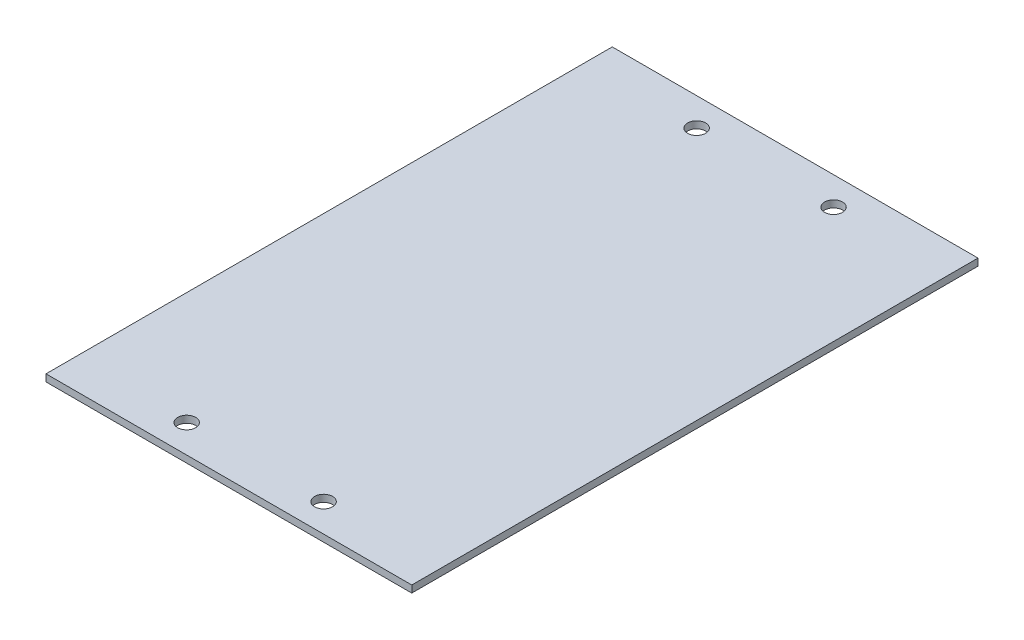
ISO-10303-21;
HEADER;
FILE_DESCRIPTION(('STEP AP214'),'2;1');
FILE_NAME('part.step','',(''),(''),'','','');
FILE_SCHEMA(('AUTOMOTIVE_DESIGN { 1 0 10303 214 1 1 1 1 }'));
ENDSEC;
DATA;
#1=APPLICATION_CONTEXT('core data for automotive mechanical design processes');
#2=APPLICATION_PROTOCOL_DEFINITION('international standard','automotive_design',2000,#1);
#3=PRODUCT_CONTEXT('',#1,'mechanical');
#4=PRODUCT('Part','Part','',(#3));
#5=PRODUCT_RELATED_PRODUCT_CATEGORY('part','',(#4));
#6=PRODUCT_DEFINITION_FORMATION('','',#4);
#7=PRODUCT_DEFINITION_CONTEXT('part definition',#1,'design');
#8=PRODUCT_DEFINITION('design','',#6,#7);
#9=PRODUCT_DEFINITION_SHAPE('','',#8);
#10=(LENGTH_UNIT() NAMED_UNIT(*) SI_UNIT(.MILLI.,.METRE.));
#11=(NAMED_UNIT(*) PLANE_ANGLE_UNIT() SI_UNIT($,.RADIAN.));
#12=(NAMED_UNIT(*) SI_UNIT($,.STERADIAN.) SOLID_ANGLE_UNIT());
#13=UNCERTAINTY_MEASURE_WITH_UNIT(LENGTH_MEASURE(1.E-05),#10,'distance_accuracy_value','');
#14=(GEOMETRIC_REPRESENTATION_CONTEXT(3) GLOBAL_UNCERTAINTY_ASSIGNED_CONTEXT((#13)) GLOBAL_UNIT_ASSIGNED_CONTEXT((#10,
#11,#12)) REPRESENTATION_CONTEXT('',''));
#15=CARTESIAN_POINT('',(0.,0.,0.));
#16=DIRECTION('',(0.,0.,1.));
#17=DIRECTION('',(1.,0.,0.));
#18=AXIS2_PLACEMENT_3D('',#15,#16,#17);
#19=CARTESIAN_POINT('',(0.,0.,-511.175));
#20=DIRECTION('',(-1.,0.,0.));
#21=DIRECTION('',(0.,0.,1.));
#22=AXIS2_PLACEMENT_3D('',#19,#20,#21);
#23=PLANE('',#22);
#24=DIRECTION('',(0.,-1.,0.));
#25=VECTOR('',#24,1.);
#26=CARTESIAN_POINT('',(0.,0.,0.));
#27=LINE('',#26,#25);
#28=CARTESIAN_POINT('',(0.,6.35,0.));
#29=VERTEX_POINT('',#28);
#30=CARTESIAN_POINT('',(0.,0.,0.));
#31=VERTEX_POINT('',#30);
#32=EDGE_CURVE('E104',#29,#31,#27,.T.);
#33=ORIENTED_EDGE('',*,*,#32,.F.);
#34=DIRECTION('',(0.,0.,1.));
#35=VECTOR('',#34,1.);
#36=CARTESIAN_POINT('',(0.,6.35,-511.175));
#37=LINE('',#36,#35);
#38=CARTESIAN_POINT('',(0.,6.35,-511.175));
#39=VERTEX_POINT('',#38);
#40=EDGE_CURVE('E11',#39,#29,#37,.T.);
#41=ORIENTED_EDGE('',*,*,#40,.F.);
#42=DIRECTION('',(0.,-1.,0.));
#43=VECTOR('',#42,1.);
#44=CARTESIAN_POINT('',(0.,0.,-511.175));
#45=LINE('',#44,#43);
#46=CARTESIAN_POINT('',(0.,0.,-511.175));
#47=VERTEX_POINT('',#46);
#48=EDGE_CURVE('E97',#39,#47,#45,.T.);
#49=ORIENTED_EDGE('',*,*,#48,.T.);
#50=DIRECTION('',(0.,0.,1.));
#51=VECTOR('',#50,1.);
#52=CARTESIAN_POINT('',(0.,0.,-511.175));
#53=LINE('',#52,#51);
#54=EDGE_CURVE('E42',#47,#31,#53,.T.);
#55=ORIENTED_EDGE('',*,*,#54,.T.);
#56=EDGE_LOOP('',(#33,#41,#49,#55));
#57=FACE_BOUND('',#56,.T.);
#58=ADVANCED_FACE('F39',(#57),#23,.T.);
#59=CARTESIAN_POINT('',(0.,6.35,-511.175));
#60=DIRECTION('',(0.,1.,0.));
#61=DIRECTION('',(0.,0.,1.));
#62=AXIS2_PLACEMENT_3D('',#59,#60,#61);
#63=PLANE('',#62);
#64=CARTESIAN_POINT('',(101.6,6.35,-485.775));
#65=DIRECTION('',(0.,1.,0.));
#66=DIRECTION('',(0.,0.,-1.));
#67=AXIS2_PLACEMENT_3D('',#64,#65,#66);
#68=CIRCLE('',#67,8.12800000000003);
#69=CARTESIAN_POINT('',(101.6,6.35,-493.903));
#70=VERTEX_POINT('',#69);
#71=EDGE_CURVE('E156',#70,#70,#68,.T.);
#72=ORIENTED_EDGE('',*,*,#71,.F.);
#73=EDGE_LOOP('',(#72));
#74=FACE_BOUND('',#73,.T.);
#75=CARTESIAN_POINT('',(225.199138423379,6.35,-485.775));
#76=DIRECTION('',(0.,1.,0.));
#77=DIRECTION('',(0.,0.,1.));
#78=AXIS2_PLACEMENT_3D('',#75,#76,#77);
#79=CIRCLE('',#78,8.12800000000003);
#80=CARTESIAN_POINT('',(225.199138423379,6.35,-477.647));
#81=VERTEX_POINT('',#80);
#82=EDGE_CURVE('E160',#81,#81,#79,.T.);
#83=ORIENTED_EDGE('',*,*,#82,.F.);
#84=EDGE_LOOP('',(#83));
#85=FACE_BOUND('',#84,.T.);
#86=CARTESIAN_POINT('',(225.199138423379,6.35,-25.4));
#87=DIRECTION('',(0.,1.,0.));
#88=DIRECTION('',(0.,0.,-1.));
#89=AXIS2_PLACEMENT_3D('',#86,#87,#88);
#90=CIRCLE('',#89,8.12800000000003);
#91=CARTESIAN_POINT('',(225.199138423379,6.35,-33.528));
#92=VERTEX_POINT('',#91);
#93=EDGE_CURVE('E153',#92,#92,#90,.T.);
#94=ORIENTED_EDGE('',*,*,#93,.F.);
#95=EDGE_LOOP('',(#94));
#96=FACE_BOUND('',#95,.T.);
#97=CARTESIAN_POINT('',(101.6,6.35,-25.4));
#98=DIRECTION('',(0.,1.,0.));
#99=DIRECTION('',(0.,0.,1.));
#100=AXIS2_PLACEMENT_3D('',#97,#98,#99);
#101=CIRCLE('',#100,8.128);
#102=CARTESIAN_POINT('',(101.6,6.35,-17.272));
#103=VERTEX_POINT('',#102);
#104=EDGE_CURVE('E108',#103,#103,#101,.T.);
#105=ORIENTED_EDGE('',*,*,#104,.F.);
#106=EDGE_LOOP('',(#105));
#107=FACE_BOUND('',#106,.T.);
#108=DIRECTION('',(-1.,0.,0.));
#109=VECTOR('',#108,1.);
#110=CARTESIAN_POINT('',(0.,6.35,0.));
#111=LINE('',#110,#109);
#112=CARTESIAN_POINT('',(330.2,6.35,0.));
#113=VERTEX_POINT('',#112);
#114=EDGE_CURVE('E99',#113,#29,#111,.T.);
#115=ORIENTED_EDGE('',*,*,#114,.F.);
#116=DIRECTION('',(0.,0.,1.));
#117=VECTOR('',#116,1.);
#118=CARTESIAN_POINT('',(330.2,6.35,-511.175));
#119=LINE('',#118,#117);
#120=CARTESIAN_POINT('',(330.2,6.35,-511.175));
#121=VERTEX_POINT('',#120);
#122=EDGE_CURVE('E48',#121,#113,#119,.T.);
#123=ORIENTED_EDGE('',*,*,#122,.F.);
#124=DIRECTION('',(-1.,0.,0.));
#125=VECTOR('',#124,1.);
#126=CARTESIAN_POINT('',(0.,6.35,-511.175));
#127=LINE('',#126,#125);
#128=EDGE_CURVE('E94',#121,#39,#127,.T.);
#129=ORIENTED_EDGE('',*,*,#128,.T.);
#130=ORIENTED_EDGE('',*,*,#40,.T.);
#131=EDGE_LOOP('',(#115,#123,#129,#130));
#132=FACE_BOUND('',#131,.T.);
#133=ADVANCED_FACE('F115',(#74,#85,#96,#107,#132),#63,.T.);
#134=CARTESIAN_POINT('',(330.2,0.,-511.175));
#135=DIRECTION('',(1.,0.,0.));
#136=DIRECTION('',(0.,0.,-1.));
#137=AXIS2_PLACEMENT_3D('',#134,#135,#136);
#138=PLANE('',#137);
#139=DIRECTION('',(0.,1.,0.));
#140=VECTOR('',#139,1.);
#141=CARTESIAN_POINT('',(330.2,0.,0.));
#142=LINE('',#141,#140);
#143=CARTESIAN_POINT('',(330.2,0.,0.));
#144=VERTEX_POINT('',#143);
#145=EDGE_CURVE('E89',#144,#113,#142,.T.);
#146=ORIENTED_EDGE('',*,*,#145,.F.);
#147=DIRECTION('',(0.,0.,1.));
#148=VECTOR('',#147,1.);
#149=CARTESIAN_POINT('',(330.2,0.,-511.175));
#150=LINE('',#149,#148);
#151=CARTESIAN_POINT('',(330.2,0.,-511.175));
#152=VERTEX_POINT('',#151);
#153=EDGE_CURVE('E84',#152,#144,#150,.T.);
#154=ORIENTED_EDGE('',*,*,#153,.F.);
#155=DIRECTION('',(0.,1.,0.));
#156=VECTOR('',#155,1.);
#157=CARTESIAN_POINT('',(330.2,0.,-511.175));
#158=LINE('',#157,#156);
#159=EDGE_CURVE('E87',#152,#121,#158,.T.);
#160=ORIENTED_EDGE('',*,*,#159,.T.);
#161=ORIENTED_EDGE('',*,*,#122,.T.);
#162=EDGE_LOOP('',(#146,#154,#160,#161));
#163=FACE_BOUND('',#162,.T.);
#164=ADVANCED_FACE('F86',(#163),#138,.T.);
#165=CARTESIAN_POINT('',(0.,0.,-511.175));
#166=DIRECTION('',(0.,-1.,0.));
#167=DIRECTION('',(0.,0.,-1.));
#168=AXIS2_PLACEMENT_3D('',#165,#166,#167);
#169=PLANE('',#168);
#170=CARTESIAN_POINT('',(101.6,0.,-485.775));
#171=DIRECTION('',(0.,1.,0.));
#172=DIRECTION('',(0.,0.,-1.));
#173=AXIS2_PLACEMENT_3D('',#170,#171,#172);
#174=CIRCLE('',#173,8.12800000000003);
#175=CARTESIAN_POINT('',(101.6,0.,-493.903));
#176=VERTEX_POINT('',#175);
#177=EDGE_CURVE('E138',#176,#176,#174,.T.);
#178=ORIENTED_EDGE('',*,*,#177,.T.);
#179=EDGE_LOOP('',(#178));
#180=FACE_BOUND('',#179,.T.);
#181=CARTESIAN_POINT('',(225.199138423379,0.,-485.775));
#182=DIRECTION('',(0.,1.,0.));
#183=DIRECTION('',(0.,0.,1.));
#184=AXIS2_PLACEMENT_3D('',#181,#182,#183);
#185=CIRCLE('',#184,8.12800000000003);
#186=CARTESIAN_POINT('',(225.199138423379,0.,-477.647));
#187=VERTEX_POINT('',#186);
#188=EDGE_CURVE('E142',#187,#187,#185,.T.);
#189=ORIENTED_EDGE('',*,*,#188,.T.);
#190=EDGE_LOOP('',(#189));
#191=FACE_BOUND('',#190,.T.);
#192=CARTESIAN_POINT('',(225.199138423379,0.,-25.4));
#193=DIRECTION('',(0.,1.,0.));
#194=DIRECTION('',(0.,0.,-1.));
#195=AXIS2_PLACEMENT_3D('',#192,#193,#194);
#196=CIRCLE('',#195,8.12800000000003);
#197=CARTESIAN_POINT('',(225.199138423379,0.,-33.528));
#198=VERTEX_POINT('',#197);
#199=EDGE_CURVE('E146',#198,#198,#196,.T.);
#200=ORIENTED_EDGE('',*,*,#199,.T.);
#201=EDGE_LOOP('',(#200));
#202=FACE_BOUND('',#201,.T.);
#203=CARTESIAN_POINT('',(101.6,0.,-25.4));
#204=DIRECTION('',(0.,1.,0.));
#205=DIRECTION('',(0.,0.,1.));
#206=AXIS2_PLACEMENT_3D('',#203,#204,#205);
#207=CIRCLE('',#206,8.128);
#208=CARTESIAN_POINT('',(101.6,0.,-17.272));
#209=VERTEX_POINT('',#208);
#210=EDGE_CURVE('E149',#209,#209,#207,.T.);
#211=ORIENTED_EDGE('',*,*,#210,.T.);
#212=EDGE_LOOP('',(#211));
#213=FACE_BOUND('',#212,.T.);
#214=DIRECTION('',(1.,0.,0.));
#215=VECTOR('',#214,1.);
#216=CARTESIAN_POINT('',(0.,0.,0.));
#217=LINE('',#216,#215);
#218=EDGE_CURVE('E107',#31,#144,#217,.T.);
#219=ORIENTED_EDGE('',*,*,#218,.F.);
#220=ORIENTED_EDGE('',*,*,#54,.F.);
#221=DIRECTION('',(1.,0.,0.));
#222=VECTOR('',#221,1.);
#223=CARTESIAN_POINT('',(0.,0.,-511.175));
#224=LINE('',#223,#222);
#225=EDGE_CURVE('E93',#47,#152,#224,.T.);
#226=ORIENTED_EDGE('',*,*,#225,.T.);
#227=ORIENTED_EDGE('',*,*,#153,.T.);
#228=EDGE_LOOP('',(#219,#220,#226,#227));
#229=FACE_BOUND('',#228,.T.);
#230=ADVANCED_FACE('F96',(#180,#191,#202,#213,#229),#169,.T.);
#231=CARTESIAN_POINT('',(0.,0.,-511.175));
#232=DIRECTION('',(0.,0.,-1.));
#233=DIRECTION('',(-1.,0.,0.));
#234=AXIS2_PLACEMENT_3D('',#231,#232,#233);
#235=PLANE('',#234);
#236=ORIENTED_EDGE('',*,*,#48,.F.);
#237=ORIENTED_EDGE('',*,*,#128,.F.);
#238=ORIENTED_EDGE('',*,*,#159,.F.);
#239=ORIENTED_EDGE('',*,*,#225,.F.);
#240=EDGE_LOOP('',(#236,#237,#238,#239));
#241=FACE_BOUND('',#240,.T.);
#242=ADVANCED_FACE('F92',(#241),#235,.T.);
#243=CARTESIAN_POINT('',(0.,0.,0.));
#244=DIRECTION('',(0.,0.,-1.));
#245=DIRECTION('',(-1.,0.,0.));
#246=AXIS2_PLACEMENT_3D('',#243,#244,#245);
#247=PLANE('',#246);
#248=ORIENTED_EDGE('',*,*,#32,.T.);
#249=ORIENTED_EDGE('',*,*,#218,.T.);
#250=ORIENTED_EDGE('',*,*,#145,.T.);
#251=ORIENTED_EDGE('',*,*,#114,.T.);
#252=EDGE_LOOP('',(#248,#249,#250,#251));
#253=FACE_BOUND('',#252,.T.);
#254=ADVANCED_FACE('F114',(#253),#247,.F.);
#255=CARTESIAN_POINT('',(101.6,6.35,-25.4));
#256=DIRECTION('',(0.,-1.,0.));
#257=DIRECTION('',(0.,0.,-1.));
#258=AXIS2_PLACEMENT_3D('',#255,#256,#257);
#259=CYLINDRICAL_SURFACE('',#258,8.128);
#260=ORIENTED_EDGE('',*,*,#104,.T.);
#261=EDGE_LOOP('',(#260));
#262=FACE_BOUND('',#261,.T.);
#263=ORIENTED_EDGE('',*,*,#210,.F.);
#264=EDGE_LOOP('',(#263));
#265=FACE_BOUND('',#264,.T.);
#266=ADVANCED_FACE('F173',(#262,#265),#259,.F.);
#267=CARTESIAN_POINT('',(225.199138423379,6.35,-25.4));
#268=DIRECTION('',(0.,-1.,0.));
#269=DIRECTION('',(0.,0.,-1.));
#270=AXIS2_PLACEMENT_3D('',#267,#268,#269);
#271=CYLINDRICAL_SURFACE('',#270,8.12800000000003);
#272=ORIENTED_EDGE('',*,*,#93,.T.);
#273=EDGE_LOOP('',(#272));
#274=FACE_BOUND('',#273,.T.);
#275=ORIENTED_EDGE('',*,*,#199,.F.);
#276=EDGE_LOOP('',(#275));
#277=FACE_BOUND('',#276,.T.);
#278=ADVANCED_FACE('F167',(#274,#277),#271,.F.);
#279=CARTESIAN_POINT('',(225.199138423379,6.35,-485.775));
#280=DIRECTION('',(0.,-1.,0.));
#281=DIRECTION('',(0.,0.,-1.));
#282=AXIS2_PLACEMENT_3D('',#279,#280,#281);
#283=CYLINDRICAL_SURFACE('',#282,8.12800000000003);
#284=ORIENTED_EDGE('',*,*,#82,.T.);
#285=EDGE_LOOP('',(#284));
#286=FACE_BOUND('',#285,.T.);
#287=ORIENTED_EDGE('',*,*,#188,.F.);
#288=EDGE_LOOP('',(#287));
#289=FACE_BOUND('',#288,.T.);
#290=ADVANCED_FACE('F178',(#286,#289),#283,.F.);
#291=CARTESIAN_POINT('',(101.6,6.35,-485.775));
#292=DIRECTION('',(0.,-1.,0.));
#293=DIRECTION('',(0.,0.,-1.));
#294=AXIS2_PLACEMENT_3D('',#291,#292,#293);
#295=CYLINDRICAL_SURFACE('',#294,8.12800000000003);
#296=ORIENTED_EDGE('',*,*,#71,.T.);
#297=EDGE_LOOP('',(#296));
#298=FACE_BOUND('',#297,.T.);
#299=ORIENTED_EDGE('',*,*,#177,.F.);
#300=EDGE_LOOP('',(#299));
#301=FACE_BOUND('',#300,.T.);
#302=ADVANCED_FACE('F181',(#298,#301),#295,.F.);
#303=CLOSED_SHELL('',(#58,#133,#164,#230,#242,#254,#266,#278,#290,#302));
#304=MANIFOLD_SOLID_BREP('B2',#303);
#305=ADVANCED_BREP_SHAPE_REPRESENTATION('',(#18,#304),#14);
#306=SHAPE_DEFINITION_REPRESENTATION(#9,#305);
ENDSEC;
END-ISO-10303-21;
